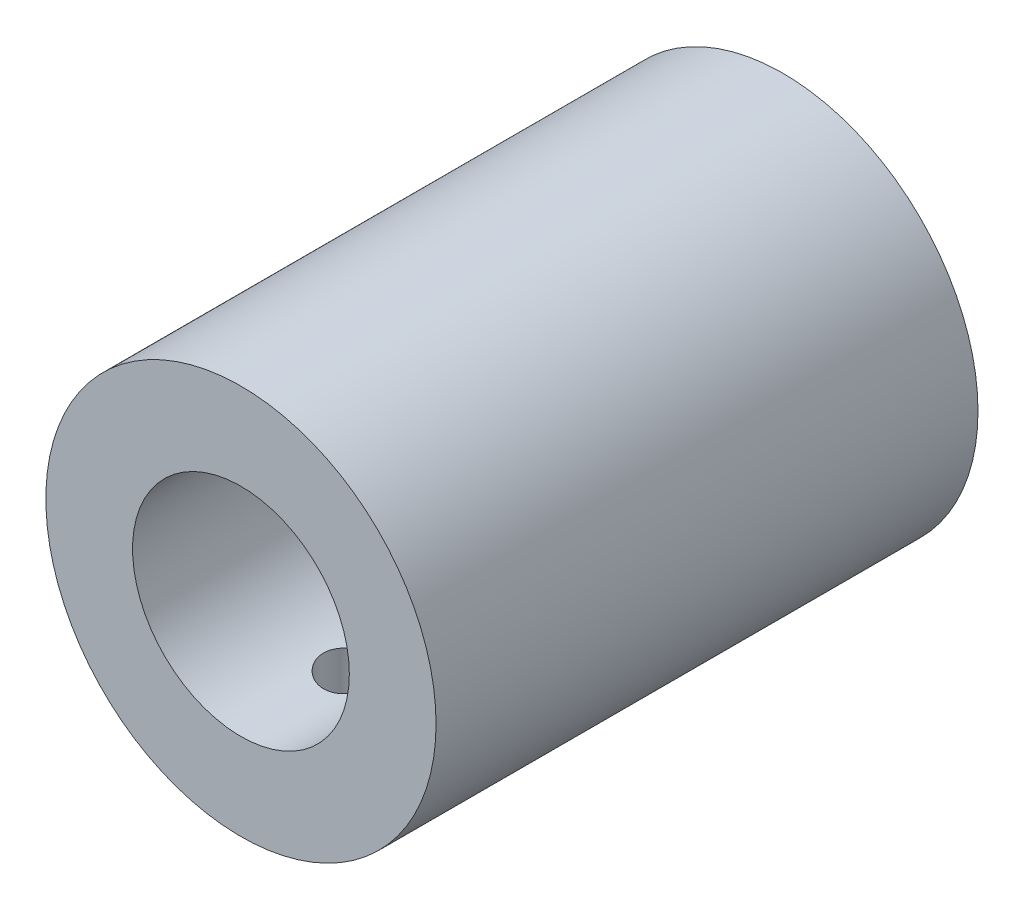
ISO-10303-21;
HEADER;
FILE_DESCRIPTION(('STEP AP214'),'2;1');
FILE_NAME('part.step','',(''),(''),'','','');
FILE_SCHEMA(('AUTOMOTIVE_DESIGN { 1 0 10303 214 1 1 1 1 }'));
ENDSEC;
DATA;
#1=APPLICATION_CONTEXT('core data for automotive mechanical design processes');
#2=APPLICATION_PROTOCOL_DEFINITION('international standard','automotive_design',2000,#1);
#3=PRODUCT_CONTEXT('',#1,'mechanical');
#4=PRODUCT('Part','Part','',(#3));
#5=PRODUCT_RELATED_PRODUCT_CATEGORY('part','',(#4));
#6=PRODUCT_DEFINITION_FORMATION('','',#4);
#7=PRODUCT_DEFINITION_CONTEXT('part definition',#1,'design');
#8=PRODUCT_DEFINITION('design','',#6,#7);
#9=PRODUCT_DEFINITION_SHAPE('','',#8);
#10=(LENGTH_UNIT() NAMED_UNIT(*) SI_UNIT(.MILLI.,.METRE.));
#11=(NAMED_UNIT(*) PLANE_ANGLE_UNIT() SI_UNIT($,.RADIAN.));
#12=(NAMED_UNIT(*) SI_UNIT($,.STERADIAN.) SOLID_ANGLE_UNIT());
#13=UNCERTAINTY_MEASURE_WITH_UNIT(LENGTH_MEASURE(1.E-05),#10,'distance_accuracy_value','');
#14=(GEOMETRIC_REPRESENTATION_CONTEXT(3) GLOBAL_UNCERTAINTY_ASSIGNED_CONTEXT((#13)) GLOBAL_UNIT_ASSIGNED_CONTEXT((#10,
#11,#12)) REPRESENTATION_CONTEXT('',''));
#15=CARTESIAN_POINT('',(0.,0.,0.));
#16=DIRECTION('',(0.,0.,1.));
#17=DIRECTION('',(1.,0.,0.));
#18=AXIS2_PLACEMENT_3D('',#15,#16,#17);
#19=CARTESIAN_POINT('',(0.,0.,25.));
#20=DIRECTION('',(0.,0.,-1.));
#21=DIRECTION('',(-1.,0.,0.));
#22=AXIS2_PLACEMENT_3D('',#19,#20,#21);
#23=CYLINDRICAL_SURFACE('',#22,3.);
#24=CARTESIAN_POINT('',(0.,-3.,6.35));
#25=CARTESIAN_POINT('',(0.0679361450543214,-2.99999423447376,6.34999237715136));
#26=CARTESIAN_POINT('',(0.135974260051901,-2.99766576234126,6.34451665680912));
#27=CARTESIAN_POINT('',(0.270117881859836,-2.98857590504162,6.32281046000083));
#28=CARTESIAN_POINT('',(0.336217981353099,-2.98180315985258,6.30655242167503));
#29=CARTESIAN_POINT('',(0.464323538713619,-2.96455146557798,6.26399385314489));
#30=CARTESIAN_POINT('',(0.526342201653478,-2.95408524469239,6.23772778743822));
#31=CARTESIAN_POINT('',(0.645031235903595,-2.93046097967626,6.1760433339406));
#32=CARTESIAN_POINT('',(0.701703125342203,-2.91730370300828,6.14062755480156));
#33=CARTESIAN_POINT('',(0.811099391490096,-2.88885125396635,6.0597249407871));
#34=CARTESIAN_POINT('',(0.863512532464561,-2.87348461499431,6.01384262603064));
#35=CARTESIAN_POINT('',(0.960169259792097,-2.84264910685304,5.91414626652099));
#36=CARTESIAN_POINT('',(1.00440841521778,-2.82718018691791,5.86032794809948));
#37=CARTESIAN_POINT('',(1.08570093234403,-2.79700401254615,5.74295141888164));
#38=CARTESIAN_POINT('',(1.12227076716169,-2.78237623494898,5.67903573566963));
#39=CARTESIAN_POINT('',(1.18400128528235,-2.75667686213076,5.5452523961329));
#40=CARTESIAN_POINT('',(1.2091680326334,-2.74560337768796,5.47538792685164));
#41=CARTESIAN_POINT('',(1.2460822110417,-2.72904243733104,5.33527312715939));
#42=CARTESIAN_POINT('',(1.25842970046635,-2.72330664653338,5.26521139430246));
#43=CARTESIAN_POINT('',(1.27122573207464,-2.71735906515923,5.12379384596104));
#44=CARTESIAN_POINT('',(1.27168114434732,-2.71714408519478,5.05243880147206));
#45=CARTESIAN_POINT('',(1.26113097803938,-2.72205294108167,4.91652802541418));
#46=CARTESIAN_POINT('',(1.25103500760011,-2.72675307672737,4.85188326515867));
#47=CARTESIAN_POINT('',(1.2211981333946,-2.74024457345548,4.72531033708823));
#48=CARTESIAN_POINT('',(1.20145531146521,-2.74903674817531,4.66338271221367));
#49=CARTESIAN_POINT('',(1.15249772901624,-2.76992195827518,4.54241231575062));
#50=CARTESIAN_POINT('',(1.12308763268412,-2.7820821742907,4.48346071972514));
#51=CARTESIAN_POINT('',(1.05576893505327,-2.80831888962248,4.37109527145726));
#52=CARTESIAN_POINT('',(1.01785692295217,-2.82239615712966,4.31768365435856));
#53=CARTESIAN_POINT('',(0.930717931378348,-2.85237875106968,4.21299489390427));
#54=CARTESIAN_POINT('',(0.880791130486782,-2.86833625010058,4.16231351253932));
#55=CARTESIAN_POINT('',(0.772993931722294,-2.89924512923984,4.06983925066231));
#56=CARTESIAN_POINT('',(0.715121558097979,-2.91419625772107,4.02804858753251));
#57=CARTESIAN_POINT('',(0.591215729452815,-2.94186768971198,3.95362963263568));
#58=CARTESIAN_POINT('',(0.52501694188106,-2.95452429459458,3.92125116482043));
#59=CARTESIAN_POINT('',(0.387439131567301,-2.97568851180469,3.8683007925787));
#60=CARTESIAN_POINT('',(0.316063092864181,-2.98419849265261,3.84772214699236));
#61=CARTESIAN_POINT('',(0.175129172040218,-2.99566373657568,3.82021984081113));
#62=CARTESIAN_POINT('',(0.105753609111518,-2.99894346595566,3.81249711997366));
#63=CARTESIAN_POINT('',(-0.0333743853407003,-3.00061995575124,3.80853433943548));
#64=CARTESIAN_POINT('',(-0.103126697958909,-2.99901817610717,3.81229084657845));
#65=CARTESIAN_POINT('',(-0.237236587211812,-2.99132110056052,3.8306145546943));
#66=CARTESIAN_POINT('',(-0.301686837489117,-2.985461870367,3.84461407713251));
#67=CARTESIAN_POINT('',(-0.42724919847595,-2.97009454835439,3.88222907302089));
#68=CARTESIAN_POINT('',(-0.488360889810137,-2.96058599932209,3.90584575140096));
#69=CARTESIAN_POINT('',(-0.607664719960659,-2.93845896630825,3.96279393824461));
#70=CARTESIAN_POINT('',(-0.665706452844805,-2.9257527729198,3.99640534857175));
#71=CARTESIAN_POINT('',(-0.775534597563816,-2.89857759537657,4.07208222307217));
#72=CARTESIAN_POINT('',(-0.827318348250779,-2.88410786651148,4.11415126365998));
#73=CARTESIAN_POINT('',(-0.927172580579112,-2.85364216711666,4.20917091784783));
#74=CARTESIAN_POINT('',(-0.974688615292094,-2.83761228125451,4.26269479336775));
#75=CARTESIAN_POINT('',(-1.06022648435413,-2.80677613051376,4.37719977025662));
#76=CARTESIAN_POINT('',(-1.09824589799668,-2.7919701782603,4.43818276708041));
#77=CARTESIAN_POINT('',(-1.16419788792218,-2.76512876173236,4.5672829707437));
#78=CARTESIAN_POINT('',(-1.19195628643749,-2.75314229282335,4.63550010851009));
#79=CARTESIAN_POINT('',(-1.23534891260728,-2.7339506945518,4.77630908155368));
#80=CARTESIAN_POINT('',(-1.25099357405257,-2.7267414512481,4.84889709389549));
#81=CARTESIAN_POINT('',(-1.26866210385953,-2.71856258857221,4.99021490080758));
#82=CARTESIAN_POINT('',(-1.27166352437167,-2.71714542165971,5.05879705403478));
#83=CARTESIAN_POINT('',(-1.2665873047831,-2.7195155690711,5.19545117696843));
#84=CARTESIAN_POINT('',(-1.25851150227992,-2.7233020201684,5.26352322941196));
#85=CARTESIAN_POINT('',(-1.23233992646109,-2.73523811866934,5.39373930185432));
#86=CARTESIAN_POINT('',(-1.21476093829486,-2.74316206830315,5.45600988969529));
#87=CARTESIAN_POINT('',(-1.17059641609387,-2.76229615887088,5.57672735220233));
#88=CARTESIAN_POINT('',(-1.14400833456402,-2.77350722918074,5.63517313974873));
#89=CARTESIAN_POINT('',(-1.08070968540352,-2.79880228937727,5.75048793544256));
#90=CARTESIAN_POINT('',(-1.04347932953539,-2.8130200844883,5.80704169690214));
#91=CARTESIAN_POINT('',(-0.960668194183152,-2.8423660828713,5.91340461920738));
#92=CARTESIAN_POINT('',(-0.915084371529823,-2.85749461657236,5.96321131055631));
#93=CARTESIAN_POINT('',(-0.812740540023621,-2.88834177300898,6.05857469362575));
#94=CARTESIAN_POINT('',(-0.75539359477438,-2.90401752136206,6.10351836173637));
#95=CARTESIAN_POINT('',(-0.633396915106783,-2.93304174815839,6.18318352542769));
#96=CARTESIAN_POINT('',(-0.568743884144719,-2.94638916908368,6.21790038093143));
#97=CARTESIAN_POINT('',(-0.434885900598597,-2.96907601358763,6.27540810045809));
#98=CARTESIAN_POINT('',(-0.365766932211316,-2.97847429766575,6.29837530534211));
#99=CARTESIAN_POINT('',(-0.224286523727192,-2.99244164026578,6.33213822124585));
#100=CARTESIAN_POINT('',(-0.151935914473652,-2.9970257283618,6.34297181959603));
#101=CARTESIAN_POINT('',(-0.0528658345263302,-2.99965265493382,6.34917765129603));
#102=CARTESIAN_POINT('',(-0.0264406402326043,-3.0000022439337,6.35000296680064));
#103=CARTESIAN_POINT('',(0.,-3.,6.35));
#104=B_SPLINE_CURVE_WITH_KNOTS('',3,(#24,#25,#26,#27,#28,#29,#30,#31,#32,#33,#34,#35,#36,#37,
#38,#39,#40,#41,#42,#43,#44,#45,#46,#47,#48,#49,#50,#51,#52,#53,#54,#55,#56,#57,#58,#59,#60,#61,
#62,#63,#64,#65,#66,#67,#68,#69,#70,#71,#72,#73,#74,#75,#76,#77,#78,#79,#80,#81,#82,#83,#84,#85,
#86,#87,#88,#89,#90,#91,#92,#93,#94,#95,#96,#97,#98,#99,#100,#101,#102,#103),.UNSPECIFIED.,.T.,
.F.,(4,2,2,2,2,2,2,2,2,2,2,2,2,2,2,2,2,2,2,2,2,2,2,2,2,2,2,2,2,2,2,2,2,2,2,2,2,2,2,4),(0.,
0.203731391846016,0.407985581417897,0.611542649629893,0.815041746118664,1.02811658368612,
1.24130658745534,1.46540543979804,1.68938497833457,1.90232941844642,2.11515083718595,
2.31102795528946,2.50694403711696,2.70709084139672,2.90731808476326,3.12506630785214,
3.34286877475624,3.56601247280789,3.78902856301214,3.99758046774876,4.20607000581715,
4.40380437308846,4.60156352205133,4.8054876835889,5.00949825907015,5.22853552476172,
5.44762856661627,5.67028626570023,5.89275197150562,6.09765988893685,6.30253381835995,
6.49724738619033,6.6920160590531,6.89870106281106,7.10546151217307,7.32797665503765,
7.55059260181378,7.7697615156144,7.98824414714238,8.06753608270306),.UNSPECIFIED.);
#105=CARTESIAN_POINT('',(0.,-3.,6.35));
#106=VERTEX_POINT('',#105);
#107=EDGE_CURVE('E98',#106,#106,#104,.T.);
#108=ORIENTED_EDGE('',*,*,#107,.F.);
#109=EDGE_LOOP('',(#108));
#110=FACE_BOUND('',#109,.T.);
#111=CARTESIAN_POINT('',(0.,0.,0.));
#112=DIRECTION('',(0.,0.,1.));
#113=DIRECTION('',(1.,0.,0.));
#114=AXIS2_PLACEMENT_3D('',#111,#112,#113);
#115=CIRCLE('',#114,3.);
#116=CARTESIAN_POINT('',(3.,0.,0.));
#117=VERTEX_POINT('',#116);
#118=EDGE_CURVE('E61',#117,#117,#115,.T.);
#119=ORIENTED_EDGE('',*,*,#118,.F.);
#120=EDGE_LOOP('',(#119));
#121=FACE_BOUND('',#120,.T.);
#122=CARTESIAN_POINT('',(0.,0.,12.554));
#123=DIRECTION('',(0.,0.,1.));
#124=DIRECTION('',(1.,0.,0.));
#125=AXIS2_PLACEMENT_3D('',#122,#123,#124);
#126=CIRCLE('',#125,3.);
#127=CARTESIAN_POINT('',(3.,0.,12.554));
#128=VERTEX_POINT('',#127);
#129=EDGE_CURVE('E66',#128,#128,#126,.T.);
#130=ORIENTED_EDGE('',*,*,#129,.T.);
#131=EDGE_LOOP('',(#130));
#132=FACE_BOUND('',#131,.T.);
#133=ADVANCED_FACE('F41',(#110,#121,#132),#23,.F.);
#134=CARTESIAN_POINT('',(0.,0.,25.));
#135=DIRECTION('',(0.,0.,1.));
#136=DIRECTION('',(1.,0.,0.));
#137=AXIS2_PLACEMENT_3D('',#134,#135,#136);
#138=PLANE('',#137);
#139=CARTESIAN_POINT('',(0.,0.,25.));
#140=DIRECTION('',(0.,0.,1.));
#141=DIRECTION('',(1.,0.,0.));
#142=AXIS2_PLACEMENT_3D('',#139,#140,#141);
#143=CIRCLE('',#142,5.);
#144=CARTESIAN_POINT('',(5.,0.,25.));
#145=VERTEX_POINT('',#144);
#146=EDGE_CURVE('E105',#145,#145,#143,.T.);
#147=ORIENTED_EDGE('',*,*,#146,.F.);
#148=EDGE_LOOP('',(#147));
#149=FACE_BOUND('',#148,.T.);
#150=CARTESIAN_POINT('',(0.,0.,25.));
#151=DIRECTION('',(0.,0.,1.));
#152=DIRECTION('',(1.,0.,0.));
#153=AXIS2_PLACEMENT_3D('',#150,#151,#152);
#154=CIRCLE('',#153,9.);
#155=CARTESIAN_POINT('',(9.,0.,25.));
#156=VERTEX_POINT('',#155);
#157=EDGE_CURVE('E10',#156,#156,#154,.T.);
#158=ORIENTED_EDGE('',*,*,#157,.T.);
#159=EDGE_LOOP('',(#158));
#160=FACE_BOUND('',#159,.T.);
#161=ADVANCED_FACE('F109',(#149,#160),#138,.T.);
#162=CARTESIAN_POINT('',(0.,0.,0.));
#163=DIRECTION('',(0.,0.,1.));
#164=DIRECTION('',(1.,0.,0.));
#165=AXIS2_PLACEMENT_3D('',#162,#163,#164);
#166=PLANE('',#165);
#167=CARTESIAN_POINT('',(0.,0.,0.));
#168=DIRECTION('',(0.,0.,1.));
#169=DIRECTION('',(1.,0.,0.));
#170=AXIS2_PLACEMENT_3D('',#167,#168,#169);
#171=CIRCLE('',#170,9.);
#172=CARTESIAN_POINT('',(9.,0.,0.));
#173=VERTEX_POINT('',#172);
#174=EDGE_CURVE('E55',#173,#173,#171,.T.);
#175=ORIENTED_EDGE('',*,*,#174,.F.);
#176=EDGE_LOOP('',(#175));
#177=FACE_BOUND('',#176,.T.);
#178=ORIENTED_EDGE('',*,*,#118,.T.);
#179=EDGE_LOOP('',(#178));
#180=FACE_BOUND('',#179,.T.);
#181=ADVANCED_FACE('F112',(#177,#180),#166,.F.);
#182=CARTESIAN_POINT('',(0.,0.,25.));
#183=DIRECTION('',(0.,0.,-1.));
#184=DIRECTION('',(-1.,0.,0.));
#185=AXIS2_PLACEMENT_3D('',#182,#183,#184);
#186=CYLINDRICAL_SURFACE('',#185,9.);
#187=CARTESIAN_POINT('',(0.,-9.,6.35));
#188=CARTESIAN_POINT('',(0.0709583545287103,-8.99999891151343,6.34999703825373));
#189=CARTESIAN_POINT('',(0.141959076913559,-8.99915199824409,6.34403297767399));
#190=CARTESIAN_POINT('',(0.281979278555848,-8.99585498417532,6.32033845759287));
#191=CARTESIAN_POINT('',(0.350996704044955,-8.99340327988541,6.30259622921716));
#192=CARTESIAN_POINT('',(0.485003404542329,-8.98717245670054,6.25588325233073));
#193=CARTESIAN_POINT('',(0.549995560058641,-8.98339430024201,6.22692064344068));
#194=CARTESIAN_POINT('',(0.674186384719249,-8.97492907819524,6.15860818491508));
#195=CARTESIAN_POINT('',(0.733385927307877,-8.97024214995573,6.11925990461092));
#196=CARTESIAN_POINT('',(0.844733174708746,-8.96044496132981,6.03100145743825));
#197=CARTESIAN_POINT('',(0.896834812328974,-8.95533225315887,5.98203343765428));
#198=CARTESIAN_POINT('',(0.992110070882197,-8.94527911163071,5.87604996083535));
#199=CARTESIAN_POINT('',(1.03528320117259,-8.94033868775332,5.81903406183991));
#200=CARTESIAN_POINT('',(1.11165247969302,-8.93116564898483,5.69826740557797));
#201=CARTESIAN_POINT('',(1.14480456501704,-8.92693619538656,5.63448852333077));
#202=CARTESIAN_POINT('',(1.19990917877593,-8.91969702956934,5.50219845811704));
#203=CARTESIAN_POINT('',(1.22186224710071,-8.91668725855254,5.43368750345834));
#204=CARTESIAN_POINT('',(1.25380368893094,-8.91225208591949,5.2943603821944));
#205=CARTESIAN_POINT('',(1.26387055852496,-8.91081629435339,5.22356254788967));
#206=CARTESIAN_POINT('',(1.27199691130706,-8.90966002328483,5.08126899390279));
#207=CARTESIAN_POINT('',(1.27005700588401,-8.90993945644255,5.00977330994046));
#208=CARTESIAN_POINT('',(1.25428913021269,-8.91217255696723,4.86866524145728));
#209=CARTESIAN_POINT('',(1.24054822195578,-8.91411396278202,4.79904290649087));
#210=CARTESIAN_POINT('',(1.20170451267635,-8.91943312096173,4.66310210842848));
#211=CARTESIAN_POINT('',(1.17660142425346,-8.92281090965906,4.5967837289514));
#212=CARTESIAN_POINT('',(1.11565425611359,-8.93063592488438,4.46906639171372));
#213=CARTESIAN_POINT('',(1.07977294099826,-8.93508684806237,4.4076854385685));
#214=CARTESIAN_POINT('',(0.998314419563576,-8.94455389007802,4.29178283567379));
#215=CARTESIAN_POINT('',(0.952736649164515,-8.94957004178918,4.23726158527309));
#216=CARTESIAN_POINT('',(0.852699373499098,-8.95965665448851,4.13612117724046));
#217=CARTESIAN_POINT('',(0.798164942472829,-8.96472720369568,4.08957610498272));
#218=CARTESIAN_POINT('',(0.682018721060246,-8.97431001473319,4.00628816251069));
#219=CARTESIAN_POINT('',(0.620406905781031,-8.97882227459976,3.96954532677479));
#220=CARTESIAN_POINT('',(0.491793297412274,-8.98678405260597,3.90690246037021));
#221=CARTESIAN_POINT('',(0.424788883497281,-8.99023305001417,3.88100774033135));
#222=CARTESIAN_POINT('',(0.28732315955707,-8.99567522394747,3.84085845730632));
#223=CARTESIAN_POINT('',(0.216862056398355,-8.99766848747821,3.8266031986521));
#224=CARTESIAN_POINT('',(0.0751229303367987,-8.99996316625159,3.81023506793173));
#225=CARTESIAN_POINT('',(0.00385689936880146,-9.0002787830281,3.80802026790686));
#226=CARTESIAN_POINT('',(-0.138029448207579,-8.99922114689086,3.81552596213187));
#227=CARTESIAN_POINT('',(-0.208649782392835,-8.99784794008825,3.82524613051296));
#228=CARTESIAN_POINT('',(-0.346934341939261,-8.99357574841684,3.85626110829388));
#229=CARTESIAN_POINT('',(-0.414609833754954,-8.99068325892798,3.87750665590116));
#230=CARTESIAN_POINT('',(-0.54543792082766,-8.98369596012311,3.93091763641523));
#231=CARTESIAN_POINT('',(-0.608590325059536,-8.97960110006417,3.96308353019588));
#232=CARTESIAN_POINT('',(-0.72903042311331,-8.97062928705282,4.03766406574892));
#233=CARTESIAN_POINT('',(-0.786277409544729,-8.96574743238191,4.08014384564181));
#234=CARTESIAN_POINT('',(-0.892865896885244,-8.95576137015274,4.1740550743603));
#235=CARTESIAN_POINT('',(-0.942206993467577,-8.9506571512392,4.22548698073932));
#236=CARTESIAN_POINT('',(-1.03195051426622,-8.9407570557552,4.3362945116272));
#237=CARTESIAN_POINT('',(-1.07228489132317,-8.93596370864722,4.39572550766248));
#238=CARTESIAN_POINT('',(-1.14239813223549,-8.92727169567961,4.52057874771949));
#239=CARTESIAN_POINT('',(-1.17217725476064,-8.92337300789604,4.58600084487232));
#240=CARTESIAN_POINT('',(-1.22022742178225,-8.91692967572409,4.72077004248913));
#241=CARTESIAN_POINT('',(-1.23853523321978,-8.91438070942662,4.79010381855663));
#242=CARTESIAN_POINT('',(-1.26324066173644,-8.91091360462609,4.93090031415316));
#243=CARTESIAN_POINT('',(-1.26963899911745,-8.90999536749437,5.00236290466284));
#244=CARTESIAN_POINT('',(-1.27032818668107,-8.90989707618246,5.14471074405623));
#245=CARTESIAN_POINT('',(-1.26472598916567,-8.91070166762072,5.21559548791745));
#246=CARTESIAN_POINT('',(-1.24180130767651,-8.91392514247873,5.3554044028202));
#247=CARTESIAN_POINT('',(-1.22447883426583,-8.91634402444357,5.42432857562867));
#248=CARTESIAN_POINT('',(-1.1786415326906,-8.92251839744045,5.55823601341409));
#249=CARTESIAN_POINT('',(-1.15013331601972,-8.92627309879528,5.62322158021377));
#250=CARTESIAN_POINT('',(-1.08274431915515,-8.93469712885947,5.74750442775125));
#251=CARTESIAN_POINT('',(-1.04386326988822,-8.93936648129423,5.80680156087573));
#252=CARTESIAN_POINT('',(-0.956440506799409,-8.94914337414384,5.91856905458804));
#253=CARTESIAN_POINT('',(-0.907819361614914,-8.95425430677365,5.97097699466616));
#254=CARTESIAN_POINT('',(-0.802464104017373,-8.96430954372724,6.06692887816135));
#255=CARTESIAN_POINT('',(-0.745728099559417,-8.96925380885802,6.11047074862845));
#256=CARTESIAN_POINT('',(-0.625432536737383,-8.9784457252228,6.18764025025434));
#257=CARTESIAN_POINT('',(-0.561841237998302,-8.98268988386721,6.22121880492033));
#258=CARTESIAN_POINT('',(-0.429893900332022,-8.98996883581808,6.27716983525094));
#259=CARTESIAN_POINT('',(-0.36154297517759,-8.9930049042488,6.29955413276021));
#260=CARTESIAN_POINT('',(-0.244055884313935,-8.99681784951454,6.32729706734305));
#261=CARTESIAN_POINT('',(-0.195651201141599,-8.99800514700489,6.33579795188905));
#262=CARTESIAN_POINT('',(-0.0981711014208901,-8.99959659474395,6.34715041351962));
#263=CARTESIAN_POINT('',(-0.0490956918367033,-9.00000075311782,6.35000204921581));
#264=CARTESIAN_POINT('',(0.,-9.,6.35));
#265=B_SPLINE_CURVE_WITH_KNOTS('',3,(#187,#188,#189,#190,#191,#192,#193,#194,#195,#196,#197,
#198,#199,#200,#201,#202,#203,#204,#205,#206,#207,#208,#209,#210,#211,#212,#213,#214,#215,#216,
#217,#218,#219,#220,#221,#222,#223,#224,#225,#226,#227,#228,#229,#230,#231,#232,#233,#234,#235,
#236,#237,#238,#239,#240,#241,#242,#243,#244,#245,#246,#247,#248,#249,#250,#251,#252,#253,#254,
#255,#256,#257,#258,#259,#260,#261,#262,#263,#264),.UNSPECIFIED.,.T.,.F.,(4,2,2,2,2,2,2,2,2,2,2,
2,2,2,2,2,2,2,2,2,2,2,2,2,2,2,2,2,2,2,2,2,2,2,2,2,2,2,4),(0.,0.212695689564771,
0.425604227530491,0.638358603217628,0.85108084894901,1.06512388954569,1.27917868919027,
1.49416144471362,1.70913383522082,1.92267846988784,2.13621223088234,2.34818404627465,
2.5601612236819,2.77287930683987,2.98560976800376,3.20022005329009,3.41483109343669,
3.62954707270343,3.84425021787229,4.05713293977181,4.27000984931484,4.4819839677486,
4.69396703328673,4.90732540699028,5.1206946888884,5.33562522133949,5.5505504862836,
5.7647833178781,5.9790031919462,6.1913218231566,6.40364026301178,6.6158333976012,
6.82803203705619,7.04203730935699,7.25609256030057,7.47118532105601,7.68605044799947,
7.83321494247669,7.98037791009655),.UNSPECIFIED.);
#266=CARTESIAN_POINT('',(0.,-9.,6.35));
#267=VERTEX_POINT('',#266);
#268=EDGE_CURVE('E46',#267,#267,#265,.T.);
#269=ORIENTED_EDGE('',*,*,#268,.T.);
#270=EDGE_LOOP('',(#269));
#271=FACE_BOUND('',#270,.T.);
#272=CARTESIAN_POINT('',(0.,-9.,21.19));
#273=CARTESIAN_POINT('',(0.0709583545287101,-8.99999891151343,21.1899970382537));
#274=CARTESIAN_POINT('',(0.141959076913559,-8.99915199824409,21.184032977674));
#275=CARTESIAN_POINT('',(0.281979278555848,-8.99585498417532,21.1603384575929));
#276=CARTESIAN_POINT('',(0.350996704044955,-8.99340327988541,21.1425962292172));
#277=CARTESIAN_POINT('',(0.485003404542328,-8.98717245670054,21.0958832523307));
#278=CARTESIAN_POINT('',(0.54999556005864,-8.98339430024201,21.0669206434407));
#279=CARTESIAN_POINT('',(0.674186384719249,-8.97492907819524,20.9986081849151));
#280=CARTESIAN_POINT('',(0.733385927307877,-8.97024214995573,20.9592599046109));
#281=CARTESIAN_POINT('',(0.844733174708745,-8.96044496132981,20.8710014574383));
#282=CARTESIAN_POINT('',(0.896834812328973,-8.95533225315887,20.8220334376543));
#283=CARTESIAN_POINT('',(0.992110070882196,-8.94527911163071,20.7160499608354));
#284=CARTESIAN_POINT('',(1.03528320117259,-8.94033868775332,20.6590340618399));
#285=CARTESIAN_POINT('',(1.11165247969302,-8.93116564898483,20.538267405578));
#286=CARTESIAN_POINT('',(1.14480456501704,-8.92693619538656,20.4744885233308));
#287=CARTESIAN_POINT('',(1.19990917877593,-8.91969702956934,20.342198458117));
#288=CARTESIAN_POINT('',(1.22186224710071,-8.91668725855254,20.2736875034583));
#289=CARTESIAN_POINT('',(1.25380368893094,-8.91225208591949,20.1343603821944));
#290=CARTESIAN_POINT('',(1.26387055852496,-8.91081629435339,20.0635625478897));
#291=CARTESIAN_POINT('',(1.27199691130706,-8.90966002328483,19.9212689939028));
#292=CARTESIAN_POINT('',(1.27005700588401,-8.90993945644255,19.8497733099405));
#293=CARTESIAN_POINT('',(1.25428913021269,-8.91217255696723,19.7086652414573));
#294=CARTESIAN_POINT('',(1.24054822195578,-8.91411396278202,19.6390429064909));
#295=CARTESIAN_POINT('',(1.20170451267634,-8.91943312096173,19.5031021084285));
#296=CARTESIAN_POINT('',(1.17660142425346,-8.92281090965906,19.4367837289514));
#297=CARTESIAN_POINT('',(1.11565425611359,-8.93063592488438,19.3090663917137));
#298=CARTESIAN_POINT('',(1.07977294099826,-8.93508684806237,19.2476854385685));
#299=CARTESIAN_POINT('',(0.998314419563576,-8.94455389007802,19.1317828356738));
#300=CARTESIAN_POINT('',(0.952736649164515,-8.94957004178918,19.0772615852731));
#301=CARTESIAN_POINT('',(0.852699373499098,-8.95965665448851,18.9761211772405));
#302=CARTESIAN_POINT('',(0.798164942472829,-8.96472720369568,18.9295761049827));
#303=CARTESIAN_POINT('',(0.682018721060247,-8.97431001473319,18.8462881625107));
#304=CARTESIAN_POINT('',(0.620406905781033,-8.97882227459976,18.8095453267748));
#305=CARTESIAN_POINT('',(0.491793297412276,-8.98678405260597,18.7469024603702));
#306=CARTESIAN_POINT('',(0.424788883497283,-8.99023305001417,18.7210077403313));
#307=CARTESIAN_POINT('',(0.287323159557071,-8.99567522394747,18.6808584573063));
#308=CARTESIAN_POINT('',(0.216862056398355,-8.99766848747821,18.6666031986521));
#309=CARTESIAN_POINT('',(0.0751229303367972,-8.99996316625159,18.6502350679317));
#310=CARTESIAN_POINT('',(0.00385689936879977,-9.0002787830281,18.6480202679069));
#311=CARTESIAN_POINT('',(-0.138029448207581,-8.99922114689086,18.6555259621319));
#312=CARTESIAN_POINT('',(-0.208649782392836,-8.99784794008825,18.665246130513));
#313=CARTESIAN_POINT('',(-0.346934341939262,-8.99357574841684,18.6962611082939));
#314=CARTESIAN_POINT('',(-0.414609833754956,-8.99068325892798,18.7175066559012));
#315=CARTESIAN_POINT('',(-0.545437920827662,-8.98369596012311,18.7709176364152));
#316=CARTESIAN_POINT('',(-0.608590325059537,-8.97960110006417,18.8030835301959));
#317=CARTESIAN_POINT('',(-0.729030423113311,-8.97062928705282,18.8776640657489));
#318=CARTESIAN_POINT('',(-0.786277409544731,-8.96574743238191,18.9201438456418));
#319=CARTESIAN_POINT('',(-0.892865896885246,-8.95576137015274,19.0140550743603));
#320=CARTESIAN_POINT('',(-0.942206993467578,-8.9506571512392,19.0654869807393));
#321=CARTESIAN_POINT('',(-1.03195051426622,-8.9407570557552,19.1762945116272));
#322=CARTESIAN_POINT('',(-1.07228489132317,-8.93596370864722,19.2357255076625));
#323=CARTESIAN_POINT('',(-1.1423981322355,-8.92727169567961,19.3605787477195));
#324=CARTESIAN_POINT('',(-1.17217725476064,-8.92337300789604,19.4260008448723));
#325=CARTESIAN_POINT('',(-1.22022742178225,-8.91692967572409,19.5607700424891));
#326=CARTESIAN_POINT('',(-1.23853523321978,-8.91438070942662,19.6301038185566));
#327=CARTESIAN_POINT('',(-1.26324066173645,-8.91091360462609,19.7709003141532));
#328=CARTESIAN_POINT('',(-1.26963899911745,-8.90999536749437,19.8423629046628));
#329=CARTESIAN_POINT('',(-1.27032818668107,-8.90989707618246,19.9847107440562));
#330=CARTESIAN_POINT('',(-1.26472598916567,-8.91070166762072,20.0555954879174));
#331=CARTESIAN_POINT('',(-1.24180130767651,-8.91392514247873,20.1954044028202));
#332=CARTESIAN_POINT('',(-1.22447883426583,-8.91634402444357,20.2643285756287));
#333=CARTESIAN_POINT('',(-1.1786415326906,-8.92251839744045,20.3982360134141));
#334=CARTESIAN_POINT('',(-1.15013331601972,-8.92627309879527,20.4632215802138));
#335=CARTESIAN_POINT('',(-1.08274431915515,-8.93469712885947,20.5875044277512));
#336=CARTESIAN_POINT('',(-1.04386326988822,-8.93936648129423,20.6468015608757));
#337=CARTESIAN_POINT('',(-0.956440506799411,-8.94914337414384,20.758569054588));
#338=CARTESIAN_POINT('',(-0.907819361614916,-8.95425430677365,20.8109769946662));
#339=CARTESIAN_POINT('',(-0.802464104017374,-8.96430954372724,20.9069288781614));
#340=CARTESIAN_POINT('',(-0.745728099559417,-8.96925380885802,20.9504707486284));
#341=CARTESIAN_POINT('',(-0.625432536737382,-8.9784457252228,21.0276402502543));
#342=CARTESIAN_POINT('',(-0.561841237998301,-8.98268988386721,21.0612188049203));
#343=CARTESIAN_POINT('',(-0.429893900332022,-8.98996883581808,21.1171698352509));
#344=CARTESIAN_POINT('',(-0.361542975177591,-8.9930049042488,21.1395541327602));
#345=CARTESIAN_POINT('',(-0.244055884313936,-8.99681784951454,21.1672970673431));
#346=CARTESIAN_POINT('',(-0.1956512011416,-8.99800514700489,21.1757979518891));
#347=CARTESIAN_POINT('',(-0.0981711014208904,-8.99959659474395,21.1871504135196));
#348=CARTESIAN_POINT('',(-0.0490956918367034,-9.00000075311782,21.1900020492158));
#349=CARTESIAN_POINT('',(0.,-9.,21.19));
#350=B_SPLINE_CURVE_WITH_KNOTS('',3,(#272,#273,#274,#275,#276,#277,#278,#279,#280,#281,#282,
#283,#284,#285,#286,#287,#288,#289,#290,#291,#292,#293,#294,#295,#296,#297,#298,#299,#300,#301,
#302,#303,#304,#305,#306,#307,#308,#309,#310,#311,#312,#313,#314,#315,#316,#317,#318,#319,#320,
#321,#322,#323,#324,#325,#326,#327,#328,#329,#330,#331,#332,#333,#334,#335,#336,#337,#338,#339,
#340,#341,#342,#343,#344,#345,#346,#347,#348,#349),.UNSPECIFIED.,.T.,.F.,(4,2,2,2,2,2,2,2,2,2,2,
2,2,2,2,2,2,2,2,2,2,2,2,2,2,2,2,2,2,2,2,2,2,2,2,2,2,2,4),(0.,0.212695689564771,
0.425604227530491,0.638358603217626,0.85108084894901,1.06512388954569,1.27917868919027,
1.49416144471362,1.70913383522082,1.92267846988784,2.13621223088235,2.34818404627466,
2.5601612236819,2.77287930683987,2.98560976800376,3.20022005329009,3.41483109343669,
3.62954707270343,3.8442502178723,4.05713293977181,4.27000984931484,4.4819839677486,
4.69396703328673,4.90732540699028,5.12069468888841,5.3356252213395,5.55055048628361,
5.76478331787811,5.97900319194621,6.1913218231566,6.40364026301179,6.61583339760121,
6.8280320370562,7.04203730935699,7.25609256030057,7.47118532105601,7.68605044799948,
7.83321494247669,7.98037791009655),.UNSPECIFIED.);
#351=CARTESIAN_POINT('',(0.,-9.,21.19));
#352=VERTEX_POINT('',#351);
#353=EDGE_CURVE('E78',#352,#352,#350,.T.);
#354=ORIENTED_EDGE('',*,*,#353,.T.);
#355=EDGE_LOOP('',(#354));
#356=FACE_BOUND('',#355,.T.);
#357=ORIENTED_EDGE('',*,*,#157,.F.);
#358=EDGE_LOOP('',(#357));
#359=FACE_BOUND('',#358,.T.);
#360=ORIENTED_EDGE('',*,*,#174,.T.);
#361=EDGE_LOOP('',(#360));
#362=FACE_BOUND('',#361,.T.);
#363=ADVANCED_FACE('F43',(#271,#356,#359,#362),#186,.T.);
#364=CARTESIAN_POINT('',(0.,0.,12.554));
#365=DIRECTION('',(0.,0.,1.));
#366=DIRECTION('',(1.,0.,0.));
#367=AXIS2_PLACEMENT_3D('',#364,#365,#366);
#368=CYLINDRICAL_SURFACE('',#367,5.);
#369=CARTESIAN_POINT('',(0.,-5.,21.19));
#370=CARTESIAN_POINT('',(-0.0701316315330853,-4.99999883996969,21.1899980993432));
#371=CARTESIAN_POINT('',(-0.140284281993127,-4.99850980752019,21.1841712845524));
#372=CARTESIAN_POINT('',(-0.278576578748404,-4.99271412097734,21.1610543708596));
#373=CARTESIAN_POINT('',(-0.346715103351159,-4.98840592664444,21.1437580055384));
#374=CARTESIAN_POINT('',(-0.478962318650793,-4.97744861748987,21.0982946171266));
#375=CARTESIAN_POINT('',(-0.543075822040379,-4.97080236361144,21.0701408755219));
#376=CARTESIAN_POINT('',(-0.665670182037174,-4.95587548440554,21.0038092353333));
#377=CARTESIAN_POINT('',(-0.724150804306978,-4.94759479112627,20.965630919956));
#378=CARTESIAN_POINT('',(-0.835059541359231,-4.93010050529124,20.8794787636149));
#379=CARTESIAN_POINT('',(-0.887351183866456,-4.92087214987343,20.8313322240246));
#380=CARTESIAN_POINT('',(-0.983211117629786,-4.90261993179739,20.7269799351616));
#381=CARTESIAN_POINT('',(-1.02677839265868,-4.89359609306999,20.6707732483381));
#382=CARTESIAN_POINT('',(-1.10460022975567,-4.87662528120326,20.5508295587422));
#383=CARTESIAN_POINT('',(-1.13870111291472,-4.86869702307761,20.4869899567965));
#384=CARTESIAN_POINT('',(-1.19563351673524,-4.85503075197243,20.3542501929952));
#385=CARTESIAN_POINT('',(-1.21846690315369,-4.84929237641132,20.2853508711382));
#386=CARTESIAN_POINT('',(-1.25174861749556,-4.84080748313233,20.145950678369));
#387=CARTESIAN_POINT('',(-1.26244281272109,-4.83800166603222,20.0755122023565));
#388=CARTESIAN_POINT('',(-1.27190857943565,-4.83552215144927,19.9337893678132));
#389=CARTESIAN_POINT('',(-1.27068215738067,-4.83584792686255,19.8625051536527));
#390=CARTESIAN_POINT('',(-1.25653744112012,-4.83954153879267,19.7230067686912));
#391=CARTESIAN_POINT('',(-1.24391317744555,-4.8428328684894,19.6547604405892));
#392=CARTESIAN_POINT('',(-1.20780061944648,-4.85196467801328,19.5213875741853));
#393=CARTESIAN_POINT('',(-1.18431152895829,-4.85780534465154,19.4562612649013));
#394=CARTESIAN_POINT('',(-1.12688810687063,-4.87144725972601,19.3301938755027));
#395=CARTESIAN_POINT('',(-1.09284791955146,-4.87926822322507,19.269303235564));
#396=CARTESIAN_POINT('',(-1.01536256788437,-4.89597850208626,19.1539933581722));
#397=CARTESIAN_POINT('',(-0.971915709097503,-4.9048680097985,19.0995752893737));
#398=CARTESIAN_POINT('',(-0.875331871232506,-4.92303502691486,18.9970714752657));
#399=CARTESIAN_POINT('',(-0.821947047678774,-4.93231625018196,18.9492196171579));
#400=CARTESIAN_POINT('',(-0.707798677005942,-4.94998500096064,18.8631023961263));
#401=CARTESIAN_POINT('',(-0.64703489004786,-4.95837249940677,18.8248373449271));
#402=CARTESIAN_POINT('',(-0.519513070081436,-4.97335272191577,18.7588900840623));
#403=CARTESIAN_POINT('',(-0.452734034861955,-4.97993880579598,18.7312468799528));
#404=CARTESIAN_POINT('',(-0.315271993567027,-4.99052591476212,18.687644543123));
#405=CARTESIAN_POINT('',(-0.244589762056372,-4.99452745074853,18.6716831011275));
#406=CARTESIAN_POINT('',(-0.103326572146756,-4.99941860481903,18.6522569197495));
#407=CARTESIAN_POINT('',(-0.0327920766955865,-5.00038748778568,18.6484737970494));
#408=CARTESIAN_POINT('',(0.107902493463701,-4.99933042951133,18.652636992004));
#409=CARTESIAN_POINT('',(0.178062602427223,-4.99730476714801,18.6605822174144));
#410=CARTESIAN_POINT('',(0.31490341156298,-4.9905371166252,18.6877144240186));
#411=CARTESIAN_POINT('',(0.381621009236902,-4.98583734305831,18.7067267998099));
#412=CARTESIAN_POINT('',(0.510915725914817,-4.97425192250216,18.755253398613));
#413=CARTESIAN_POINT('',(0.573492418338121,-4.96736605073149,18.7847687016059));
#414=CARTESIAN_POINT('',(0.693988809176052,-4.95198335705001,18.8540741211262));
#415=CARTESIAN_POINT('',(0.751803097566195,-4.94345951147018,18.8940413628686));
#416=CARTESIAN_POINT('',(0.860016978445535,-4.92578747324009,18.9828906191654));
#417=CARTESIAN_POINT('',(0.910415244931099,-4.91663916936214,19.0317742244974));
#418=CARTESIAN_POINT('',(1.00368550943715,-4.89846245783945,19.1385487395089));
#419=CARTESIAN_POINT('',(1.0463338455318,-4.88944299650573,19.1966368838812));
#420=CARTESIAN_POINT('',(1.12127837448332,-4.87280353111206,19.3193324277555));
#421=CARTESIAN_POINT('',(1.15357502278557,-4.8651834654889,19.3839395402766));
#422=CARTESIAN_POINT('',(1.20665767490907,-4.8522905673807,19.5174967622535));
#423=CARTESIAN_POINT('',(1.22751174593065,-4.84700389215158,19.5864184114631));
#424=CARTESIAN_POINT('',(1.25729285812289,-4.83936519540768,19.7269450147475));
#425=CARTESIAN_POINT('',(1.2662226087251,-4.83701250724348,19.7985493554612));
#426=CARTESIAN_POINT('',(1.27175661205525,-4.83556013693897,19.940129601189));
#427=CARTESIAN_POINT('',(1.26871879654071,-4.83636598408136,20.0100907668026));
#428=CARTESIAN_POINT('',(1.25122568778986,-4.84092081613421,20.1484681695144));
#429=CARTESIAN_POINT('',(1.23677063850912,-4.84466973815906,20.2168844395907));
#430=CARTESIAN_POINT('',(1.1970517675253,-4.85463480243111,20.349826418981));
#431=CARTESIAN_POINT('',(1.17185712552274,-4.86083513555623,20.4143740639554));
#432=CARTESIAN_POINT('',(1.11142868540972,-4.8750061690739,20.5383729450643));
#433=CARTESIAN_POINT('',(1.07619345080957,-4.88297712274999,20.5978234503758));
#434=CARTESIAN_POINT('',(0.995570672179561,-4.900058927485,20.7116651792213));
#435=CARTESIAN_POINT('',(0.949935724981934,-4.90919465691996,20.7658774864545));
#436=CARTESIAN_POINT('',(0.85028833791354,-4.92743044120705,20.8659911816675));
#437=CARTESIAN_POINT('',(0.796273901378349,-4.93653048702525,20.9118905831838));
#438=CARTESIAN_POINT('',(0.680171183723109,-4.95387450730628,20.9949213767875));
#439=CARTESIAN_POINT('',(0.617949832164116,-4.96209909726594,21.0318710593052));
#440=CARTESIAN_POINT('',(0.487974473061203,-4.97655933603024,21.094727165139));
#441=CARTESIAN_POINT('',(0.420224373732957,-4.98279637477654,21.1206413101524));
#442=CARTESIAN_POINT('',(0.29385393436636,-4.99168357699708,21.1569526850643));
#443=CARTESIAN_POINT('',(0.235822712698924,-4.99478051176934,21.1693181817251));
#444=CARTESIAN_POINT('',(0.118532599479891,-4.99893913173213,21.1858423127228));
#445=CARTESIAN_POINT('',(0.0592738069454262,-5.00000098043367,21.1900016063959));
#446=CARTESIAN_POINT('',(0.,-5.,21.19));
#447=B_SPLINE_CURVE_WITH_KNOTS('',3,(#369,#370,#371,#372,#373,#374,#375,#376,#377,#378,#379,
#380,#381,#382,#383,#384,#385,#386,#387,#388,#389,#390,#391,#392,#393,#394,#395,#396,#397,#398,
#399,#400,#401,#402,#403,#404,#405,#406,#407,#408,#409,#410,#411,#412,#413,#414,#415,#416,#417,
#418,#419,#420,#421,#422,#423,#424,#425,#426,#427,#428,#429,#430,#431,#432,#433,#434,#435,#436,
#437,#438,#439,#440,#441,#442,#443,#444,#445,#446),.UNSPECIFIED.,.T.,.F.,(4,2,2,2,2,2,2,2,2,2,2,
2,2,2,2,2,2,2,2,2,2,2,2,2,2,2,2,2,2,2,2,2,2,2,2,2,2,2,4),(0.,0.210177641716539,
0.420470209256104,0.630506344357465,0.840551213547609,1.05459614996047,1.26866600415962,
1.48603114200553,1.70336027480662,1.91620436228179,2.12901262485898,2.33648316824852,
2.54396891728213,2.75360763774909,2.9632841522422,3.17914011000701,3.39500308563247,
3.61165134570179,3.82825676671094,4.0391513344497,4.25002626311886,4.45766109685199,
4.66531728716278,4.8767505690138,5.08822160985707,5.30506359081236,5.52189603001552,
5.73742423820481,5.95290346596336,6.16198768639907,6.37106743938822,6.57882027523845,
6.78660284885241,6.99996980684717,7.21338768422501,7.43083099907901,7.64812191525804,
7.82577399267328,8.00341179585876),.UNSPECIFIED.);
#448=CARTESIAN_POINT('',(0.,-5.,21.19));
#449=VERTEX_POINT('',#448);
#450=EDGE_CURVE('E70',#449,#449,#447,.T.);
#451=ORIENTED_EDGE('',*,*,#450,.T.);
#452=EDGE_LOOP('',(#451));
#453=FACE_BOUND('',#452,.T.);
#454=CARTESIAN_POINT('',(0.,0.,12.554));
#455=DIRECTION('',(0.,0.,1.));
#456=DIRECTION('',(1.,0.,0.));
#457=AXIS2_PLACEMENT_3D('',#454,#455,#456);
#458=CIRCLE('',#457,5.);
#459=CARTESIAN_POINT('',(5.,0.,12.554));
#460=VERTEX_POINT('',#459);
#461=EDGE_CURVE('E69',#460,#460,#458,.T.);
#462=ORIENTED_EDGE('',*,*,#461,.F.);
#463=EDGE_LOOP('',(#462));
#464=FACE_BOUND('',#463,.T.);
#465=ORIENTED_EDGE('',*,*,#146,.T.);
#466=EDGE_LOOP('',(#465));
#467=FACE_BOUND('',#466,.T.);
#468=ADVANCED_FACE('F79',(#453,#464,#467),#368,.F.);
#469=CARTESIAN_POINT('',(0.,0.,12.554));
#470=DIRECTION('',(0.,0.,1.));
#471=DIRECTION('',(1.,0.,0.));
#472=AXIS2_PLACEMENT_3D('',#469,#470,#471);
#473=PLANE('',#472);
#474=ORIENTED_EDGE('',*,*,#129,.F.);
#475=EDGE_LOOP('',(#474));
#476=FACE_BOUND('',#475,.T.);
#477=ORIENTED_EDGE('',*,*,#461,.T.);
#478=EDGE_LOOP('',(#477));
#479=FACE_BOUND('',#478,.T.);
#480=ADVANCED_FACE('F87',(#476,#479),#473,.T.);
#481=CARTESIAN_POINT('',(0.,-12.446,19.92));
#482=DIRECTION('',(0.,1.,0.));
#483=DIRECTION('',(0.,0.,1.));
#484=AXIS2_PLACEMENT_3D('',#481,#482,#483);
#485=CYLINDRICAL_SURFACE('',#484,1.27);
#486=ORIENTED_EDGE('',*,*,#450,.F.);
#487=EDGE_LOOP('',(#486));
#488=FACE_BOUND('',#487,.T.);
#489=ORIENTED_EDGE('',*,*,#353,.F.);
#490=EDGE_LOOP('',(#489));
#491=FACE_BOUND('',#490,.T.);
#492=ADVANCED_FACE('F83',(#488,#491),#485,.F.);
#493=CARTESIAN_POINT('',(0.,-12.446,5.08));
#494=DIRECTION('',(0.,1.,0.));
#495=DIRECTION('',(0.,0.,1.));
#496=AXIS2_PLACEMENT_3D('',#493,#494,#495);
#497=CYLINDRICAL_SURFACE('',#496,1.27);
#498=ORIENTED_EDGE('',*,*,#107,.T.);
#499=EDGE_LOOP('',(#498));
#500=FACE_BOUND('',#499,.T.);
#501=ORIENTED_EDGE('',*,*,#268,.F.);
#502=EDGE_LOOP('',(#501));
#503=FACE_BOUND('',#502,.T.);
#504=ADVANCED_FACE('F86',(#500,#503),#497,.F.);
#505=CLOSED_SHELL('',(#133,#161,#181,#363,#468,#480,#492,#504));
#506=MANIFOLD_SOLID_BREP('B2',#505);
#507=ADVANCED_BREP_SHAPE_REPRESENTATION('',(#18,#506),#14);
#508=SHAPE_DEFINITION_REPRESENTATION(#9,#507);
ENDSEC;
END-ISO-10303-21;
